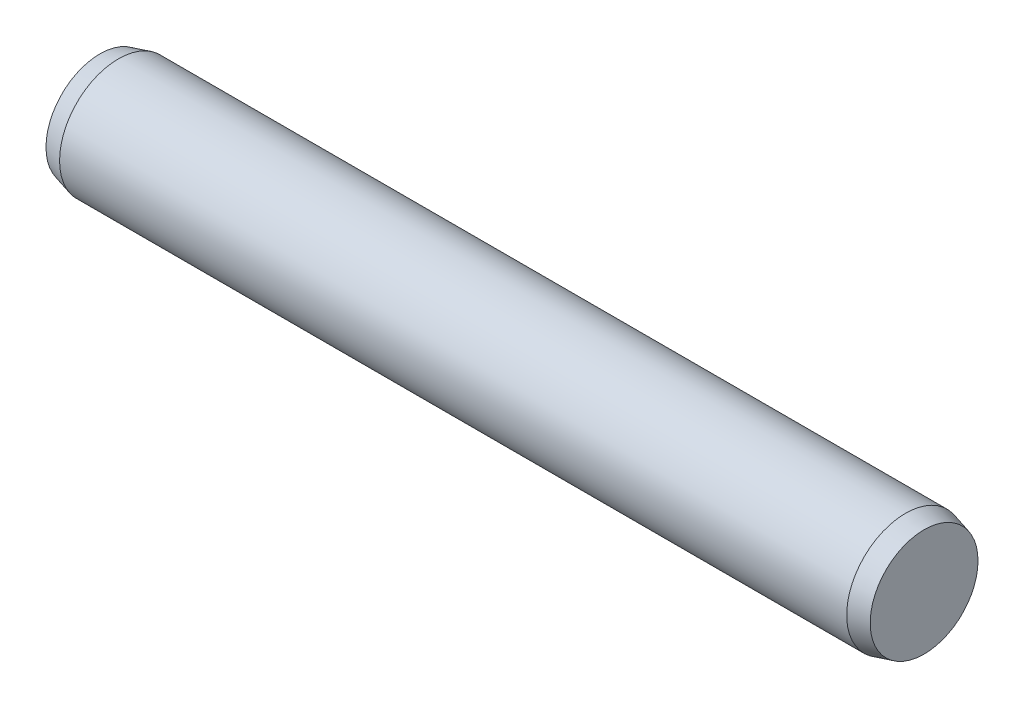
ISO-10303-21;
HEADER;
FILE_DESCRIPTION(('STEP AP214'),'2;1');
FILE_NAME('part.step','',(''),(''),'','','');
FILE_SCHEMA(('AUTOMOTIVE_DESIGN { 1 0 10303 214 1 1 1 1 }'));
ENDSEC;
DATA;
#1=APPLICATION_CONTEXT('core data for automotive mechanical design processes');
#2=APPLICATION_PROTOCOL_DEFINITION('international standard','automotive_design',2000,#1);
#3=PRODUCT_CONTEXT('',#1,'mechanical');
#4=PRODUCT('Part','Part','',(#3));
#5=PRODUCT_RELATED_PRODUCT_CATEGORY('part','',(#4));
#6=PRODUCT_DEFINITION_FORMATION('','',#4);
#7=PRODUCT_DEFINITION_CONTEXT('part definition',#1,'design');
#8=PRODUCT_DEFINITION('design','',#6,#7);
#9=PRODUCT_DEFINITION_SHAPE('','',#8);
#10=(LENGTH_UNIT() NAMED_UNIT(*) SI_UNIT(.MILLI.,.METRE.));
#11=(NAMED_UNIT(*) PLANE_ANGLE_UNIT() SI_UNIT($,.RADIAN.));
#12=(NAMED_UNIT(*) SI_UNIT($,.STERADIAN.) SOLID_ANGLE_UNIT());
#13=UNCERTAINTY_MEASURE_WITH_UNIT(LENGTH_MEASURE(1.E-05),#10,'distance_accuracy_value','');
#14=(GEOMETRIC_REPRESENTATION_CONTEXT(3) GLOBAL_UNCERTAINTY_ASSIGNED_CONTEXT((#13)) GLOBAL_UNIT_ASSIGNED_CONTEXT((#10,
#11,#12)) REPRESENTATION_CONTEXT('',''));
#15=CARTESIAN_POINT('',(0.,0.,0.));
#16=DIRECTION('',(0.,0.,1.));
#17=DIRECTION('',(1.,0.,0.));
#18=AXIS2_PLACEMENT_3D('',#15,#16,#17);
#19=CARTESIAN_POINT('',(-13.37,0.,0.));
#20=DIRECTION('',(1.,0.,0.));
#21=DIRECTION('',(0.,0.,-1.));
#22=AXIS2_PLACEMENT_3D('',#19,#20,#21);
#23=CYLINDRICAL_SURFACE('',#22,2.);
#24=CARTESIAN_POINT('',(-13.37,0.,0.));
#25=DIRECTION('',(-1.,0.,0.));
#26=DIRECTION('',(0.,0.,1.));
#27=AXIS2_PLACEMENT_3D('',#24,#25,#26);
#28=CIRCLE('',#27,2.);
#29=CARTESIAN_POINT('',(-13.37,0.,2.));
#30=VERTEX_POINT('',#29);
#31=EDGE_CURVE('E64',#30,#30,#28,.T.);
#32=ORIENTED_EDGE('',*,*,#31,.F.);
#33=EDGE_LOOP('',(#32));
#34=FACE_BOUND('',#33,.T.);
#35=CARTESIAN_POINT('',(13.37,0.,0.));
#36=DIRECTION('',(1.,0.,0.));
#37=DIRECTION('',(0.,0.,-1.));
#38=AXIS2_PLACEMENT_3D('',#35,#36,#37);
#39=CIRCLE('',#38,2.);
#40=CARTESIAN_POINT('',(13.37,0.,-2.));
#41=VERTEX_POINT('',#40);
#42=EDGE_CURVE('E10',#41,#41,#39,.T.);
#43=ORIENTED_EDGE('',*,*,#42,.F.);
#44=EDGE_LOOP('',(#43));
#45=FACE_BOUND('',#44,.T.);
#46=ADVANCED_FACE('F45',(#34,#45),#23,.T.);
#47=CARTESIAN_POINT('',(13.37,0.,0.));
#48=DIRECTION('',(-1.,0.,0.));
#49=DIRECTION('',(0.,0.,-1.));
#50=AXIS2_PLACEMENT_3D('',#47,#48,#49);
#51=CONICAL_SURFACE('',#50,2.,0.26179938779915);
#52=CARTESIAN_POINT('',(14.,0.,0.));
#53=DIRECTION('',(1.,0.,0.));
#54=DIRECTION('',(0.,0.,-1.));
#55=AXIS2_PLACEMENT_3D('',#52,#53,#54);
#56=CIRCLE('',#55,1.83119200876839);
#57=CARTESIAN_POINT('',(14.,0.,-1.83119200876839));
#58=VERTEX_POINT('',#57);
#59=EDGE_CURVE('E52',#58,#58,#56,.T.);
#60=ORIENTED_EDGE('',*,*,#59,.F.);
#61=EDGE_LOOP('',(#60));
#62=FACE_BOUND('',#61,.T.);
#63=ORIENTED_EDGE('',*,*,#42,.T.);
#64=EDGE_LOOP('',(#63));
#65=FACE_BOUND('',#64,.T.);
#66=ADVANCED_FACE('F76',(#62,#65),#51,.T.);
#67=CARTESIAN_POINT('',(14.,0.,0.));
#68=DIRECTION('',(1.,0.,0.));
#69=DIRECTION('',(0.,0.,-1.));
#70=AXIS2_PLACEMENT_3D('',#67,#68,#69);
#71=PLANE('',#70);
#72=ORIENTED_EDGE('',*,*,#59,.T.);
#73=EDGE_LOOP('',(#72));
#74=FACE_BOUND('',#73,.T.);
#75=ADVANCED_FACE('F80',(#74),#71,.T.);
#76=CARTESIAN_POINT('',(-13.37,0.,0.));
#77=DIRECTION('',(1.,0.,0.));
#78=DIRECTION('',(0.,0.,1.));
#79=AXIS2_PLACEMENT_3D('',#76,#77,#78);
#80=CONICAL_SURFACE('',#79,2.,0.26179938779915);
#81=CARTESIAN_POINT('',(-14.,0.,0.));
#82=DIRECTION('',(-1.,0.,0.));
#83=DIRECTION('',(0.,0.,1.));
#84=AXIS2_PLACEMENT_3D('',#81,#82,#83);
#85=CIRCLE('',#84,1.83119200876839);
#86=CARTESIAN_POINT('',(-14.,0.,1.83119200876839));
#87=VERTEX_POINT('',#86);
#88=EDGE_CURVE('E58',#87,#87,#85,.T.);
#89=ORIENTED_EDGE('',*,*,#88,.F.);
#90=EDGE_LOOP('',(#89));
#91=FACE_BOUND('',#90,.T.);
#92=ORIENTED_EDGE('',*,*,#31,.T.);
#93=EDGE_LOOP('',(#92));
#94=FACE_BOUND('',#93,.T.);
#95=ADVANCED_FACE('F72',(#91,#94),#80,.T.);
#96=CARTESIAN_POINT('',(-14.,0.,0.));
#97=DIRECTION('',(-1.,0.,0.));
#98=DIRECTION('',(0.,0.,1.));
#99=AXIS2_PLACEMENT_3D('',#96,#97,#98);
#100=PLANE('',#99);
#101=ORIENTED_EDGE('',*,*,#88,.T.);
#102=EDGE_LOOP('',(#101));
#103=FACE_BOUND('',#102,.T.);
#104=ADVANCED_FACE('F89',(#103),#100,.T.);
#105=CLOSED_SHELL('',(#46,#66,#75,#95,#104));
#106=MANIFOLD_SOLID_BREP('B2',#105);
#107=ADVANCED_BREP_SHAPE_REPRESENTATION('',(#18,#106),#14);
#108=SHAPE_DEFINITION_REPRESENTATION(#9,#107);
ENDSEC;
END-ISO-10303-21;
